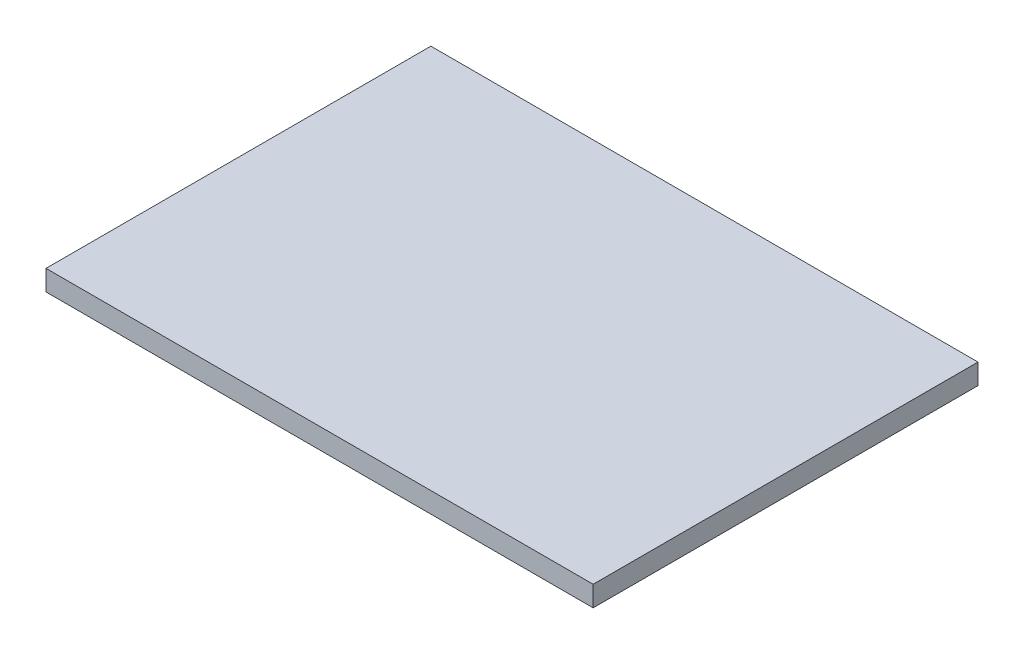
ISO-10303-21;
HEADER;
FILE_DESCRIPTION(('STEP AP214'),'2;1');
FILE_NAME('part.step','',(''),(''),'','','');
FILE_SCHEMA(('AUTOMOTIVE_DESIGN { 1 0 10303 214 1 1 1 1 }'));
ENDSEC;
DATA;
#1=APPLICATION_CONTEXT('core data for automotive mechanical design processes');
#2=APPLICATION_PROTOCOL_DEFINITION('international standard','automotive_design',2000,#1);
#3=PRODUCT_CONTEXT('',#1,'mechanical');
#4=PRODUCT('Part','Part','',(#3));
#5=PRODUCT_RELATED_PRODUCT_CATEGORY('part','',(#4));
#6=PRODUCT_DEFINITION_FORMATION('','',#4);
#7=PRODUCT_DEFINITION_CONTEXT('part definition',#1,'design');
#8=PRODUCT_DEFINITION('design','',#6,#7);
#9=PRODUCT_DEFINITION_SHAPE('','',#8);
#10=(LENGTH_UNIT() NAMED_UNIT(*) SI_UNIT(.MILLI.,.METRE.));
#11=(NAMED_UNIT(*) PLANE_ANGLE_UNIT() SI_UNIT($,.RADIAN.));
#12=(NAMED_UNIT(*) SI_UNIT($,.STERADIAN.) SOLID_ANGLE_UNIT());
#13=UNCERTAINTY_MEASURE_WITH_UNIT(LENGTH_MEASURE(1.E-05),#10,'distance_accuracy_value','');
#14=(GEOMETRIC_REPRESENTATION_CONTEXT(3) GLOBAL_UNCERTAINTY_ASSIGNED_CONTEXT((#13)) GLOBAL_UNIT_ASSIGNED_CONTEXT((#10,
#11,#12)) REPRESENTATION_CONTEXT('',''));
#15=CARTESIAN_POINT('',(0.,0.,0.));
#16=DIRECTION('',(0.,0.,1.));
#17=DIRECTION('',(1.,0.,0.));
#18=AXIS2_PLACEMENT_3D('',#15,#16,#17);
#19=CARTESIAN_POINT('',(187.325,14.,131.7625));
#20=DIRECTION('',(-1.,0.,0.));
#21=DIRECTION('',(0.,0.,1.));
#22=AXIS2_PLACEMENT_3D('',#19,#20,#21);
#23=PLANE('',#22);
#24=DIRECTION('',(0.,0.,-1.));
#25=VECTOR('',#24,1.);
#26=CARTESIAN_POINT('',(187.325,0.,131.7625));
#27=LINE('',#26,#25);
#28=CARTESIAN_POINT('',(187.325,0.,131.7625));
#29=VERTEX_POINT('',#28);
#30=CARTESIAN_POINT('',(187.325,0.,-131.7625));
#31=VERTEX_POINT('',#30);
#32=EDGE_CURVE('E96',#29,#31,#27,.T.);
#33=ORIENTED_EDGE('',*,*,#32,.T.);
#34=DIRECTION('',(0.,-1.,0.));
#35=VECTOR('',#34,1.);
#36=CARTESIAN_POINT('',(187.325,14.,-131.7625));
#37=LINE('',#36,#35);
#38=CARTESIAN_POINT('',(187.325,14.,-131.7625));
#39=VERTEX_POINT('',#38);
#40=EDGE_CURVE('E11',#39,#31,#37,.T.);
#41=ORIENTED_EDGE('',*,*,#40,.F.);
#42=DIRECTION('',(0.,0.,-1.));
#43=VECTOR('',#42,1.);
#44=CARTESIAN_POINT('',(187.325,14.,131.7625));
#45=LINE('',#44,#43);
#46=CARTESIAN_POINT('',(187.325,14.,131.7625));
#47=VERTEX_POINT('',#46);
#48=EDGE_CURVE('E84',#47,#39,#45,.T.);
#49=ORIENTED_EDGE('',*,*,#48,.F.);
#50=DIRECTION('',(0.,-1.,0.));
#51=VECTOR('',#50,1.);
#52=CARTESIAN_POINT('',(187.325,14.,131.7625));
#53=LINE('',#52,#51);
#54=EDGE_CURVE('E92',#47,#29,#53,.T.);
#55=ORIENTED_EDGE('',*,*,#54,.T.);
#56=EDGE_LOOP('',(#33,#41,#49,#55));
#57=FACE_BOUND('',#56,.T.);
#58=ADVANCED_FACE('F33',(#57),#23,.F.);
#59=CARTESIAN_POINT('',(-187.325,14.,-131.7625));
#60=DIRECTION('',(0.,0.,1.));
#61=DIRECTION('',(1.,0.,0.));
#62=AXIS2_PLACEMENT_3D('',#59,#60,#61);
#63=PLANE('',#62);
#64=DIRECTION('',(-1.,0.,0.));
#65=VECTOR('',#64,1.);
#66=CARTESIAN_POINT('',(-187.325,0.,-131.7625));
#67=LINE('',#66,#65);
#68=CARTESIAN_POINT('',(-187.325,0.,-131.7625));
#69=VERTEX_POINT('',#68);
#70=EDGE_CURVE('E88',#31,#69,#67,.T.);
#71=ORIENTED_EDGE('',*,*,#70,.T.);
#72=DIRECTION('',(0.,-1.,0.));
#73=VECTOR('',#72,1.);
#74=CARTESIAN_POINT('',(-187.325,14.,-131.7625));
#75=LINE('',#74,#73);
#76=CARTESIAN_POINT('',(-187.325,14.,-131.7625));
#77=VERTEX_POINT('',#76);
#78=EDGE_CURVE('E41',#77,#69,#75,.T.);
#79=ORIENTED_EDGE('',*,*,#78,.F.);
#80=DIRECTION('',(-1.,0.,0.));
#81=VECTOR('',#80,1.);
#82=CARTESIAN_POINT('',(-187.325,14.,-131.7625));
#83=LINE('',#82,#81);
#84=EDGE_CURVE('E79',#39,#77,#83,.T.);
#85=ORIENTED_EDGE('',*,*,#84,.F.);
#86=ORIENTED_EDGE('',*,*,#40,.T.);
#87=EDGE_LOOP('',(#71,#79,#85,#86));
#88=FACE_BOUND('',#87,.T.);
#89=ADVANCED_FACE('F87',(#88),#63,.F.);
#90=CARTESIAN_POINT('',(-187.325,14.,131.7625));
#91=DIRECTION('',(1.,0.,0.));
#92=DIRECTION('',(0.,0.,-1.));
#93=AXIS2_PLACEMENT_3D('',#90,#91,#92);
#94=PLANE('',#93);
#95=DIRECTION('',(0.,0.,1.));
#96=VECTOR('',#95,1.);
#97=CARTESIAN_POINT('',(-187.325,0.,131.7625));
#98=LINE('',#97,#96);
#99=CARTESIAN_POINT('',(-187.325,0.,131.7625));
#100=VERTEX_POINT('',#99);
#101=EDGE_CURVE('E66',#69,#100,#98,.T.);
#102=ORIENTED_EDGE('',*,*,#101,.T.);
#103=DIRECTION('',(0.,-1.,0.));
#104=VECTOR('',#103,1.);
#105=CARTESIAN_POINT('',(-187.325,14.,131.7625));
#106=LINE('',#105,#104);
#107=CARTESIAN_POINT('',(-187.325,14.,131.7625));
#108=VERTEX_POINT('',#107);
#109=EDGE_CURVE('E89',#108,#100,#106,.T.);
#110=ORIENTED_EDGE('',*,*,#109,.F.);
#111=DIRECTION('',(0.,0.,1.));
#112=VECTOR('',#111,1.);
#113=CARTESIAN_POINT('',(-187.325,14.,131.7625));
#114=LINE('',#113,#112);
#115=EDGE_CURVE('E82',#77,#108,#114,.T.);
#116=ORIENTED_EDGE('',*,*,#115,.F.);
#117=ORIENTED_EDGE('',*,*,#78,.T.);
#118=EDGE_LOOP('',(#102,#110,#116,#117));
#119=FACE_BOUND('',#118,.T.);
#120=ADVANCED_FACE('F90',(#119),#94,.F.);
#121=CARTESIAN_POINT('',(-187.325,14.,131.7625));
#122=DIRECTION('',(0.,0.,-1.));
#123=DIRECTION('',(-1.,0.,0.));
#124=AXIS2_PLACEMENT_3D('',#121,#122,#123);
#125=PLANE('',#124);
#126=DIRECTION('',(1.,0.,0.));
#127=VECTOR('',#126,1.);
#128=CARTESIAN_POINT('',(-187.325,0.,131.7625));
#129=LINE('',#128,#127);
#130=EDGE_CURVE('E72',#100,#29,#129,.T.);
#131=ORIENTED_EDGE('',*,*,#130,.T.);
#132=ORIENTED_EDGE('',*,*,#54,.F.);
#133=DIRECTION('',(1.,0.,0.));
#134=VECTOR('',#133,1.);
#135=CARTESIAN_POINT('',(-187.325,14.,131.7625));
#136=LINE('',#135,#134);
#137=EDGE_CURVE('E49',#108,#47,#136,.T.);
#138=ORIENTED_EDGE('',*,*,#137,.F.);
#139=ORIENTED_EDGE('',*,*,#109,.T.);
#140=EDGE_LOOP('',(#131,#132,#138,#139));
#141=FACE_BOUND('',#140,.T.);
#142=ADVANCED_FACE('F103',(#141),#125,.F.);
#143=CARTESIAN_POINT('',(0.,14.,0.));
#144=DIRECTION('',(0.,-1.,0.));
#145=DIRECTION('',(0.,0.,-1.));
#146=AXIS2_PLACEMENT_3D('',#143,#144,#145);
#147=PLANE('',#146);
#148=ORIENTED_EDGE('',*,*,#48,.T.);
#149=ORIENTED_EDGE('',*,*,#84,.T.);
#150=ORIENTED_EDGE('',*,*,#115,.T.);
#151=ORIENTED_EDGE('',*,*,#137,.T.);
#152=EDGE_LOOP('',(#148,#149,#150,#151));
#153=FACE_BOUND('',#152,.T.);
#154=ADVANCED_FACE('F80',(#153),#147,.F.);
#155=CARTESIAN_POINT('',(0.,0.,0.));
#156=DIRECTION('',(0.,-1.,0.));
#157=DIRECTION('',(0.,0.,-1.));
#158=AXIS2_PLACEMENT_3D('',#155,#156,#157);
#159=PLANE('',#158);
#160=ORIENTED_EDGE('',*,*,#32,.F.);
#161=ORIENTED_EDGE('',*,*,#130,.F.);
#162=ORIENTED_EDGE('',*,*,#101,.F.);
#163=ORIENTED_EDGE('',*,*,#70,.F.);
#164=EDGE_LOOP('',(#160,#161,#162,#163));
#165=FACE_BOUND('',#164,.T.);
#166=ADVANCED_FACE('F106',(#165),#159,.T.);
#167=CLOSED_SHELL('',(#58,#89,#120,#142,#154,#166));
#168=MANIFOLD_SOLID_BREP('B2',#167);
#169=ADVANCED_BREP_SHAPE_REPRESENTATION('',(#18,#168),#14);
#170=SHAPE_DEFINITION_REPRESENTATION(#9,#169);
ENDSEC;
END-ISO-10303-21;
